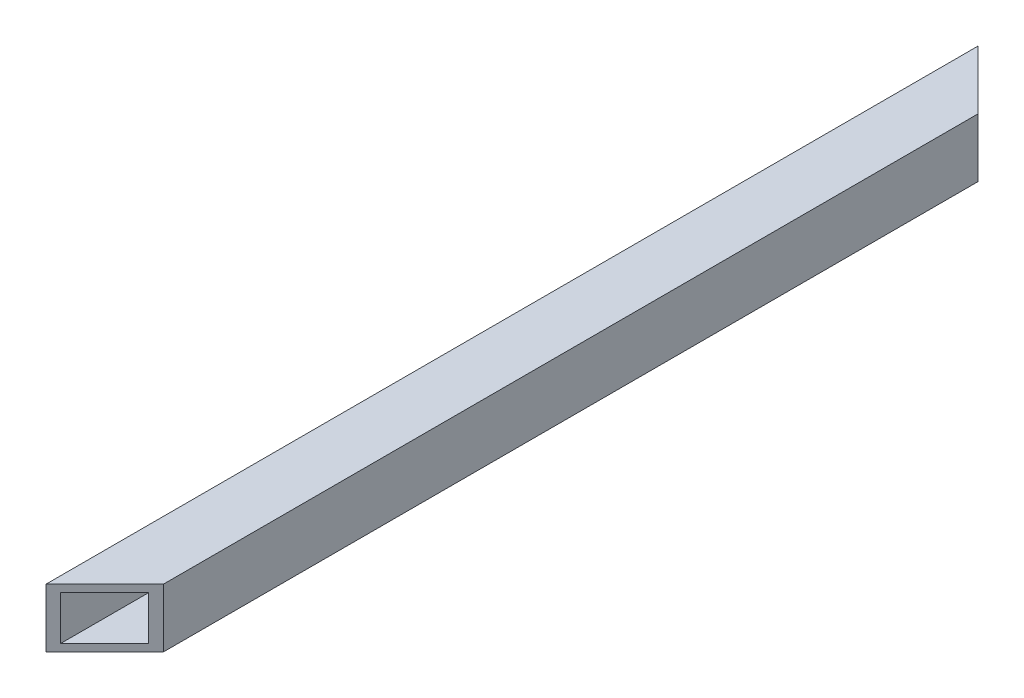
ISO-10303-21;
HEADER;
FILE_DESCRIPTION(('STEP AP214'),'2;1');
FILE_NAME('part.step','',(''),(''),'','','');
FILE_SCHEMA(('AUTOMOTIVE_DESIGN { 1 0 10303 214 1 1 1 1 }'));
ENDSEC;
DATA;
#1=APPLICATION_CONTEXT('core data for automotive mechanical design processes');
#2=APPLICATION_PROTOCOL_DEFINITION('international standard','automotive_design',2000,#1);
#3=PRODUCT_CONTEXT('',#1,'mechanical');
#4=PRODUCT('Part','Part','',(#3));
#5=PRODUCT_RELATED_PRODUCT_CATEGORY('part','',(#4));
#6=PRODUCT_DEFINITION_FORMATION('','',#4);
#7=PRODUCT_DEFINITION_CONTEXT('part definition',#1,'design');
#8=PRODUCT_DEFINITION('design','',#6,#7);
#9=PRODUCT_DEFINITION_SHAPE('','',#8);
#10=(LENGTH_UNIT() NAMED_UNIT(*) SI_UNIT(.MILLI.,.METRE.));
#11=(NAMED_UNIT(*) PLANE_ANGLE_UNIT() SI_UNIT($,.RADIAN.));
#12=(NAMED_UNIT(*) SI_UNIT($,.STERADIAN.) SOLID_ANGLE_UNIT());
#13=UNCERTAINTY_MEASURE_WITH_UNIT(LENGTH_MEASURE(1.E-05),#10,'distance_accuracy_value','');
#14=(GEOMETRIC_REPRESENTATION_CONTEXT(3) GLOBAL_UNCERTAINTY_ASSIGNED_CONTEXT((#13)) GLOBAL_UNIT_ASSIGNED_CONTEXT((#10,
#11,#12)) REPRESENTATION_CONTEXT('',''));
#15=CARTESIAN_POINT('',(0.,0.,0.));
#16=DIRECTION('',(0.,0.,1.));
#17=DIRECTION('',(1.,0.,0.));
#18=AXIS2_PLACEMENT_3D('',#15,#16,#17);
#19=CARTESIAN_POINT('',(-12.7,12.7,-201.6125));
#20=DIRECTION('',(-0.707106781186546,0.,0.707106781186549));
#21=DIRECTION('',(0.707106781186549,0.,0.707106781186546));
#22=AXIS2_PLACEMENT_3D('',#19,#20,#21);
#23=PLANE('',#22);
#24=DIRECTION('',(0.707106781186549,0.,0.707106781186546));
#25=VECTOR('',#24,1.);
#26=CARTESIAN_POINT('',(44.053125,-12.7,-144.859375));
#27=LINE('',#26,#25);
#28=CARTESIAN_POINT('',(-12.7,-12.7,-201.6125));
#29=VERTEX_POINT('',#28);
#30=CARTESIAN_POINT('',(12.7,-12.7,-176.2125));
#31=VERTEX_POINT('',#30);
#32=EDGE_CURVE('E9',#29,#31,#27,.T.);
#33=ORIENTED_EDGE('',*,*,#32,.F.);
#34=DIRECTION('',(0.,-1.,0.));
#35=VECTOR('',#34,1.);
#36=CARTESIAN_POINT('',(-12.7,-12.7,-201.6125));
#37=LINE('',#36,#35);
#38=CARTESIAN_POINT('',(-12.7,12.7,-201.6125));
#39=VERTEX_POINT('',#38);
#40=EDGE_CURVE('E34',#39,#29,#37,.T.);
#41=ORIENTED_EDGE('',*,*,#40,.F.);
#42=DIRECTION('',(-0.707106781186549,0.,-0.707106781186546));
#43=VECTOR('',#42,1.);
#44=CARTESIAN_POINT('',(37.703125,12.7,-151.209375));
#45=LINE('',#44,#43);
#46=CARTESIAN_POINT('',(12.7,12.7,-176.2125));
#47=VERTEX_POINT('',#46);
#48=EDGE_CURVE('E139',#47,#39,#45,.T.);
#49=ORIENTED_EDGE('',*,*,#48,.F.);
#50=DIRECTION('',(0.,1.,0.));
#51=VECTOR('',#50,1.);
#52=CARTESIAN_POINT('',(12.7,12.7,-176.2125));
#53=LINE('',#52,#51);
#54=EDGE_CURVE('E110',#31,#47,#53,.T.);
#55=ORIENTED_EDGE('',*,*,#54,.F.);
#56=EDGE_LOOP('',(#33,#41,#49,#55));
#57=FACE_BOUND('',#56,.T.);
#58=DIRECTION('',(0.,1.,0.));
#59=VECTOR('',#58,1.);
#60=CARTESIAN_POINT('',(-9.52500000000001,1.5875,-198.4375));
#61=LINE('',#60,#59);
#62=CARTESIAN_POINT('',(-9.525,-9.525,-198.4375));
#63=VERTEX_POINT('',#62);
#64=CARTESIAN_POINT('',(-9.525,9.525,-198.4375));
#65=VERTEX_POINT('',#64);
#66=EDGE_CURVE('E102',#63,#65,#61,.T.);
#67=ORIENTED_EDGE('',*,*,#66,.F.);
#68=DIRECTION('',(-0.707106781186549,0.,-0.707106781186546));
#69=VECTOR('',#68,1.);
#70=CARTESIAN_POINT('',(43.259375,-9.525,-145.653125));
#71=LINE('',#70,#69);
#72=CARTESIAN_POINT('',(9.525,-9.525,-179.3875));
#73=VERTEX_POINT('',#72);
#74=EDGE_CURVE('E112',#73,#63,#71,.T.);
#75=ORIENTED_EDGE('',*,*,#74,.F.);
#76=DIRECTION('',(0.,-1.,0.));
#77=VECTOR('',#76,1.);
#78=CARTESIAN_POINT('',(9.52500000000001,11.1125,-179.3875));
#79=LINE('',#78,#77);
#80=CARTESIAN_POINT('',(9.525,9.525,-179.3875));
#81=VERTEX_POINT('',#80);
#82=EDGE_CURVE('E116',#81,#73,#79,.T.);
#83=ORIENTED_EDGE('',*,*,#82,.F.);
#84=DIRECTION('',(0.707106781186549,0.,0.707106781186546));
#85=VECTOR('',#84,1.);
#86=CARTESIAN_POINT('',(38.496875,9.525,-150.415625));
#87=LINE('',#86,#85);
#88=EDGE_CURVE('E89',#65,#81,#87,.T.);
#89=ORIENTED_EDGE('',*,*,#88,.F.);
#90=EDGE_LOOP('',(#67,#75,#83,#89));
#91=FACE_BOUND('',#90,.T.);
#92=ADVANCED_FACE('F15',(#57,#91),#23,.F.);
#93=CARTESIAN_POINT('',(12.7,-12.7,0.));
#94=DIRECTION('',(0.,-1.,0.));
#95=DIRECTION('',(0.,0.,-1.));
#96=AXIS2_PLACEMENT_3D('',#93,#94,#95);
#97=PLANE('',#96);
#98=ORIENTED_EDGE('',*,*,#32,.T.);
#99=DIRECTION('',(0.,0.,-1.));
#100=VECTOR('',#99,1.);
#101=CARTESIAN_POINT('',(12.7,-12.7,0.));
#102=LINE('',#101,#100);
#103=CARTESIAN_POINT('',(12.7,-12.7,176.2125));
#104=VERTEX_POINT('',#103);
#105=EDGE_CURVE('E119',#104,#31,#102,.T.);
#106=ORIENTED_EDGE('',*,*,#105,.F.);
#107=DIRECTION('',(-0.707106781186547,0.,0.707106781186548));
#108=VECTOR('',#107,1.);
#109=CARTESIAN_POINT('',(56.753125,-12.7,132.159375));
#110=LINE('',#109,#108);
#111=CARTESIAN_POINT('',(-12.7,-12.7,201.6125));
#112=VERTEX_POINT('',#111);
#113=EDGE_CURVE('E25',#104,#112,#110,.T.);
#114=ORIENTED_EDGE('',*,*,#113,.T.);
#115=DIRECTION('',(0.,0.,-1.));
#116=VECTOR('',#115,1.);
#117=CARTESIAN_POINT('',(-12.7,-12.7,0.));
#118=LINE('',#117,#116);
#119=EDGE_CURVE('E127',#112,#29,#118,.T.);
#120=ORIENTED_EDGE('',*,*,#119,.T.);
#121=EDGE_LOOP('',(#98,#106,#114,#120));
#122=FACE_BOUND('',#121,.T.);
#123=ADVANCED_FACE('F156',(#122),#97,.T.);
#124=CARTESIAN_POINT('',(12.7,12.7,0.));
#125=DIRECTION('',(1.,0.,0.));
#126=DIRECTION('',(0.,0.,-1.));
#127=AXIS2_PLACEMENT_3D('',#124,#125,#126);
#128=PLANE('',#127);
#129=ORIENTED_EDGE('',*,*,#54,.T.);
#130=DIRECTION('',(0.,0.,-1.));
#131=VECTOR('',#130,1.);
#132=CARTESIAN_POINT('',(12.7,12.7,0.));
#133=LINE('',#132,#131);
#134=CARTESIAN_POINT('',(12.7,12.7,176.2125));
#135=VERTEX_POINT('',#134);
#136=EDGE_CURVE('E103',#135,#47,#133,.T.);
#137=ORIENTED_EDGE('',*,*,#136,.F.);
#138=DIRECTION('',(0.,-1.,0.));
#139=VECTOR('',#138,1.);
#140=CARTESIAN_POINT('',(12.7,12.7,176.2125));
#141=LINE('',#140,#139);
#142=EDGE_CURVE('E124',#135,#104,#141,.T.);
#143=ORIENTED_EDGE('',*,*,#142,.T.);
#144=ORIENTED_EDGE('',*,*,#105,.T.);
#145=EDGE_LOOP('',(#129,#137,#143,#144));
#146=FACE_BOUND('',#145,.T.);
#147=ADVANCED_FACE('F161',(#146),#128,.T.);
#148=CARTESIAN_POINT('',(9.525,9.525,0.));
#149=DIRECTION('',(1.,0.,0.));
#150=DIRECTION('',(0.,0.,-1.));
#151=AXIS2_PLACEMENT_3D('',#148,#149,#150);
#152=PLANE('',#151);
#153=ORIENTED_EDGE('',*,*,#82,.T.);
#154=DIRECTION('',(0.,0.,1.));
#155=VECTOR('',#154,1.);
#156=CARTESIAN_POINT('',(9.525,-9.525,0.));
#157=LINE('',#156,#155);
#158=CARTESIAN_POINT('',(9.525,-9.525,179.3875));
#159=VERTEX_POINT('',#158);
#160=EDGE_CURVE('E120',#73,#159,#157,.T.);
#161=ORIENTED_EDGE('',*,*,#160,.T.);
#162=DIRECTION('',(0.,1.,0.));
#163=VECTOR('',#162,1.);
#164=CARTESIAN_POINT('',(9.52500000000001,11.1125,179.3875));
#165=LINE('',#164,#163);
#166=CARTESIAN_POINT('',(9.525,9.525,179.3875));
#167=VERTEX_POINT('',#166);
#168=EDGE_CURVE('E134',#159,#167,#165,.T.);
#169=ORIENTED_EDGE('',*,*,#168,.T.);
#170=DIRECTION('',(0.,0.,-1.));
#171=VECTOR('',#170,1.);
#172=CARTESIAN_POINT('',(9.525,9.525,0.));
#173=LINE('',#172,#171);
#174=EDGE_CURVE('E86',#167,#81,#173,.T.);
#175=ORIENTED_EDGE('',*,*,#174,.T.);
#176=EDGE_LOOP('',(#153,#161,#169,#175));
#177=FACE_BOUND('',#176,.T.);
#178=ADVANCED_FACE('F168',(#177),#152,.F.);
#179=CARTESIAN_POINT('',(9.525,-9.525,0.));
#180=DIRECTION('',(0.,-1.,0.));
#181=DIRECTION('',(0.,0.,-1.));
#182=AXIS2_PLACEMENT_3D('',#179,#180,#181);
#183=PLANE('',#182);
#184=ORIENTED_EDGE('',*,*,#74,.T.);
#185=DIRECTION('',(0.,0.,1.));
#186=VECTOR('',#185,1.);
#187=CARTESIAN_POINT('',(-9.525,-9.525,0.));
#188=LINE('',#187,#186);
#189=CARTESIAN_POINT('',(-9.525,-9.525,198.4375));
#190=VERTEX_POINT('',#189);
#191=EDGE_CURVE('E115',#63,#190,#188,.T.);
#192=ORIENTED_EDGE('',*,*,#191,.T.);
#193=DIRECTION('',(0.707106781186547,0.,-0.707106781186548));
#194=VECTOR('',#193,1.);
#195=CARTESIAN_POINT('',(55.959375,-9.525,132.953125));
#196=LINE('',#195,#194);
#197=EDGE_CURVE('E95',#190,#159,#196,.T.);
#198=ORIENTED_EDGE('',*,*,#197,.T.);
#199=ORIENTED_EDGE('',*,*,#160,.F.);
#200=EDGE_LOOP('',(#184,#192,#198,#199));
#201=FACE_BOUND('',#200,.T.);
#202=ADVANCED_FACE('F172',(#201),#183,.F.);
#203=CARTESIAN_POINT('',(12.7,12.7,176.2125));
#204=DIRECTION('',(-0.707106781186548,0.,-0.707106781186547));
#205=DIRECTION('',(-0.707106781186547,0.,0.707106781186548));
#206=AXIS2_PLACEMENT_3D('',#203,#204,#205);
#207=PLANE('',#206);
#208=ORIENTED_EDGE('',*,*,#113,.F.);
#209=ORIENTED_EDGE('',*,*,#142,.F.);
#210=DIRECTION('',(0.707106781186547,0.,-0.707106781186548));
#211=VECTOR('',#210,1.);
#212=CARTESIAN_POINT('',(50.403125,12.7,138.509375));
#213=LINE('',#212,#211);
#214=CARTESIAN_POINT('',(-12.7,12.7,201.6125));
#215=VERTEX_POINT('',#214);
#216=EDGE_CURVE('E106',#215,#135,#213,.T.);
#217=ORIENTED_EDGE('',*,*,#216,.F.);
#218=DIRECTION('',(0.,1.,0.));
#219=VECTOR('',#218,1.);
#220=CARTESIAN_POINT('',(-12.7,-12.7,201.6125));
#221=LINE('',#220,#219);
#222=EDGE_CURVE('E75',#112,#215,#221,.T.);
#223=ORIENTED_EDGE('',*,*,#222,.F.);
#224=EDGE_LOOP('',(#208,#209,#217,#223));
#225=FACE_BOUND('',#224,.T.);
#226=ORIENTED_EDGE('',*,*,#168,.F.);
#227=ORIENTED_EDGE('',*,*,#197,.F.);
#228=DIRECTION('',(0.,-1.,0.));
#229=VECTOR('',#228,1.);
#230=CARTESIAN_POINT('',(-9.525,1.5875,198.4375));
#231=LINE('',#230,#229);
#232=CARTESIAN_POINT('',(-9.525,9.525,198.4375));
#233=VERTEX_POINT('',#232);
#234=EDGE_CURVE('E92',#233,#190,#231,.T.);
#235=ORIENTED_EDGE('',*,*,#234,.F.);
#236=DIRECTION('',(-0.707106781186547,0.,0.707106781186548));
#237=VECTOR('',#236,1.);
#238=CARTESIAN_POINT('',(51.196875,9.525,137.715625));
#239=LINE('',#238,#237);
#240=EDGE_CURVE('E81',#167,#233,#239,.T.);
#241=ORIENTED_EDGE('',*,*,#240,.F.);
#242=EDGE_LOOP('',(#226,#227,#235,#241));
#243=FACE_BOUND('',#242,.T.);
#244=ADVANCED_FACE('F93',(#225,#243),#207,.F.);
#245=CARTESIAN_POINT('',(-12.7,12.7,0.));
#246=DIRECTION('',(0.,1.,0.));
#247=DIRECTION('',(0.,0.,1.));
#248=AXIS2_PLACEMENT_3D('',#245,#246,#247);
#249=PLANE('',#248);
#250=ORIENTED_EDGE('',*,*,#48,.T.);
#251=DIRECTION('',(0.,0.,1.));
#252=VECTOR('',#251,1.);
#253=CARTESIAN_POINT('',(-12.7,12.7,0.));
#254=LINE('',#253,#252);
#255=EDGE_CURVE('E142',#39,#215,#254,.T.);
#256=ORIENTED_EDGE('',*,*,#255,.T.);
#257=ORIENTED_EDGE('',*,*,#216,.T.);
#258=ORIENTED_EDGE('',*,*,#136,.T.);
#259=EDGE_LOOP('',(#250,#256,#257,#258));
#260=FACE_BOUND('',#259,.T.);
#261=ADVANCED_FACE('F147',(#260),#249,.T.);
#262=CARTESIAN_POINT('',(-9.525,-9.525,0.));
#263=DIRECTION('',(-1.,0.,0.));
#264=DIRECTION('',(0.,0.,1.));
#265=AXIS2_PLACEMENT_3D('',#262,#263,#264);
#266=PLANE('',#265);
#267=ORIENTED_EDGE('',*,*,#66,.T.);
#268=DIRECTION('',(0.,0.,1.));
#269=VECTOR('',#268,1.);
#270=CARTESIAN_POINT('',(-9.525,9.525,0.));
#271=LINE('',#270,#269);
#272=EDGE_CURVE('E19',#65,#233,#271,.T.);
#273=ORIENTED_EDGE('',*,*,#272,.T.);
#274=ORIENTED_EDGE('',*,*,#234,.T.);
#275=ORIENTED_EDGE('',*,*,#191,.F.);
#276=EDGE_LOOP('',(#267,#273,#274,#275));
#277=FACE_BOUND('',#276,.T.);
#278=ADVANCED_FACE('F101',(#277),#266,.F.);
#279=CARTESIAN_POINT('',(-9.525,9.525,0.));
#280=DIRECTION('',(0.,1.,0.));
#281=DIRECTION('',(0.,0.,1.));
#282=AXIS2_PLACEMENT_3D('',#279,#280,#281);
#283=PLANE('',#282);
#284=ORIENTED_EDGE('',*,*,#88,.T.);
#285=ORIENTED_EDGE('',*,*,#174,.F.);
#286=ORIENTED_EDGE('',*,*,#240,.T.);
#287=ORIENTED_EDGE('',*,*,#272,.F.);
#288=EDGE_LOOP('',(#284,#285,#286,#287));
#289=FACE_BOUND('',#288,.T.);
#290=ADVANCED_FACE('F83',(#289),#283,.F.);
#291=CARTESIAN_POINT('',(-12.7,-12.7,0.));
#292=DIRECTION('',(-1.,0.,0.));
#293=DIRECTION('',(0.,0.,1.));
#294=AXIS2_PLACEMENT_3D('',#291,#292,#293);
#295=PLANE('',#294);
#296=ORIENTED_EDGE('',*,*,#222,.T.);
#297=ORIENTED_EDGE('',*,*,#255,.F.);
#298=ORIENTED_EDGE('',*,*,#40,.T.);
#299=ORIENTED_EDGE('',*,*,#119,.F.);
#300=EDGE_LOOP('',(#296,#297,#298,#299));
#301=FACE_BOUND('',#300,.T.);
#302=ADVANCED_FACE('F17',(#301),#295,.T.);
#303=CLOSED_SHELL('',(#92,#123,#147,#178,#202,#244,#261,#278,#290,#302));
#304=MANIFOLD_SOLID_BREP('B1',#303);
#305=ADVANCED_BREP_SHAPE_REPRESENTATION('',(#18,#304),#14);
#306=SHAPE_DEFINITION_REPRESENTATION(#9,#305);
ENDSEC;
END-ISO-10303-21;
